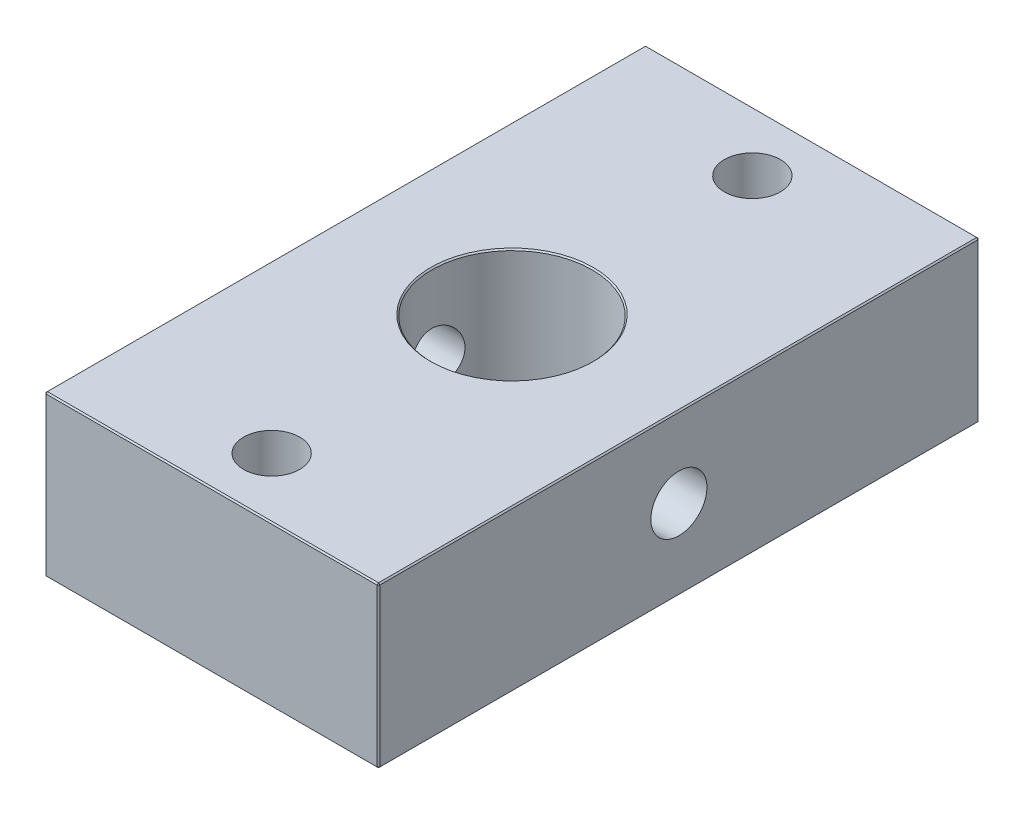
ISO-10303-21;
HEADER;
FILE_DESCRIPTION(('STEP AP214'),'2;1');
FILE_NAME('part.step','',(''),(''),'','','');
FILE_SCHEMA(('AUTOMOTIVE_DESIGN { 1 0 10303 214 1 1 1 1 }'));
ENDSEC;
DATA;
#1=APPLICATION_CONTEXT('core data for automotive mechanical design processes');
#2=APPLICATION_PROTOCOL_DEFINITION('international standard','automotive_design',2000,#1);
#3=PRODUCT_CONTEXT('',#1,'mechanical');
#4=PRODUCT('Part','Part','',(#3));
#5=PRODUCT_RELATED_PRODUCT_CATEGORY('part','',(#4));
#6=PRODUCT_DEFINITION_FORMATION('','',#4);
#7=PRODUCT_DEFINITION_CONTEXT('part definition',#1,'design');
#8=PRODUCT_DEFINITION('design','',#6,#7);
#9=PRODUCT_DEFINITION_SHAPE('','',#8);
#10=(LENGTH_UNIT() NAMED_UNIT(*) SI_UNIT(.MILLI.,.METRE.));
#11=(NAMED_UNIT(*) PLANE_ANGLE_UNIT() SI_UNIT($,.RADIAN.));
#12=(NAMED_UNIT(*) SI_UNIT($,.STERADIAN.) SOLID_ANGLE_UNIT());
#13=UNCERTAINTY_MEASURE_WITH_UNIT(LENGTH_MEASURE(1.E-05),#10,'distance_accuracy_value','');
#14=(GEOMETRIC_REPRESENTATION_CONTEXT(3) GLOBAL_UNCERTAINTY_ASSIGNED_CONTEXT((#13)) GLOBAL_UNIT_ASSIGNED_CONTEXT((#10,
#11,#12)) REPRESENTATION_CONTEXT('',''));
#15=CARTESIAN_POINT('',(0.,0.,0.));
#16=DIRECTION('',(0.,0.,1.));
#17=DIRECTION('',(1.,0.,0.));
#18=AXIS2_PLACEMENT_3D('',#15,#16,#17);
#19=CARTESIAN_POINT('',(0.,12.,0.));
#20=DIRECTION('',(0.,-1.,0.));
#21=DIRECTION('',(0.,0.,-1.));
#22=AXIS2_PLACEMENT_3D('',#19,#20,#21);
#23=PLANE('',#22);
#24=CARTESIAN_POINT('',(0.,12.,0.));
#25=DIRECTION('',(0.,-1.,0.));
#26=DIRECTION('',(0.,0.,-1.));
#27=AXIS2_PLACEMENT_3D('',#24,#25,#26);
#28=CIRCLE('',#27,6.10000000000001);
#29=CARTESIAN_POINT('',(0.,12.,-6.10000000000001));
#30=VERTEX_POINT('',#29);
#31=EDGE_CURVE('E472',#30,#30,#28,.T.);
#32=ORIENTED_EDGE('',*,*,#31,.T.);
#33=EDGE_LOOP('',(#32));
#34=FACE_BOUND('',#33,.T.);
#35=DIRECTION('',(0.,0.,1.));
#36=VECTOR('',#35,1.);
#37=CARTESIAN_POINT('',(-12.4,12.,0.));
#38=LINE('',#37,#36);
#39=CARTESIAN_POINT('',(-12.4,12.,-22.4));
#40=VERTEX_POINT('',#39);
#41=CARTESIAN_POINT('',(-12.4,12.,22.4));
#42=VERTEX_POINT('',#41);
#43=EDGE_CURVE('E463',#40,#42,#38,.T.);
#44=ORIENTED_EDGE('',*,*,#43,.T.);
#45=DIRECTION('',(1.,0.,0.));
#46=VECTOR('',#45,1.);
#47=CARTESIAN_POINT('',(0.,12.,22.4));
#48=LINE('',#47,#46);
#49=CARTESIAN_POINT('',(12.4,12.,22.4));
#50=VERTEX_POINT('',#49);
#51=EDGE_CURVE('E467',#42,#50,#48,.T.);
#52=ORIENTED_EDGE('',*,*,#51,.T.);
#53=DIRECTION('',(0.,0.,-1.));
#54=VECTOR('',#53,1.);
#55=CARTESIAN_POINT('',(12.4,12.,0.));
#56=LINE('',#55,#54);
#57=CARTESIAN_POINT('',(12.4,12.,-22.4));
#58=VERTEX_POINT('',#57);
#59=EDGE_CURVE('E468',#50,#58,#56,.T.);
#60=ORIENTED_EDGE('',*,*,#59,.T.);
#61=DIRECTION('',(-1.,0.,0.));
#62=VECTOR('',#61,1.);
#63=CARTESIAN_POINT('',(0.,12.,-22.4));
#64=LINE('',#63,#62);
#65=EDGE_CURVE('E474',#58,#40,#64,.T.);
#66=ORIENTED_EDGE('',*,*,#65,.T.);
#67=EDGE_LOOP('',(#44,#52,#60,#66));
#68=FACE_BOUND('',#67,.T.);
#69=CARTESIAN_POINT('',(0.,12.,-18.));
#70=DIRECTION('',(0.,1.,0.));
#71=DIRECTION('',(0.,0.,1.));
#72=AXIS2_PLACEMENT_3D('',#69,#70,#71);
#73=CIRCLE('',#72,2.09999999999999);
#74=CARTESIAN_POINT('',(0.,12.,-15.9));
#75=VERTEX_POINT('',#74);
#76=EDGE_CURVE('E245',#75,#75,#73,.T.);
#77=ORIENTED_EDGE('',*,*,#76,.F.);
#78=EDGE_LOOP('',(#77));
#79=FACE_BOUND('',#78,.T.);
#80=CARTESIAN_POINT('',(0.,12.,18.));
#81=DIRECTION('',(0.,1.,0.));
#82=DIRECTION('',(0.,0.,1.));
#83=AXIS2_PLACEMENT_3D('',#80,#81,#82);
#84=CIRCLE('',#83,2.09999999999999);
#85=CARTESIAN_POINT('',(0.,12.,20.1));
#86=VERTEX_POINT('',#85);
#87=EDGE_CURVE('E254',#86,#86,#84,.T.);
#88=ORIENTED_EDGE('',*,*,#87,.F.);
#89=EDGE_LOOP('',(#88));
#90=FACE_BOUND('',#89,.T.);
#91=ADVANCED_FACE('F47',(#34,#68,#79,#90),#23,.F.);
#92=CARTESIAN_POINT('',(0.,0.,0.));
#93=DIRECTION('',(0.,-1.,0.));
#94=DIRECTION('',(0.,0.,-1.));
#95=AXIS2_PLACEMENT_3D('',#92,#93,#94);
#96=PLANE('',#95);
#97=CARTESIAN_POINT('',(0.,0.,0.));
#98=DIRECTION('',(0.,-1.,0.));
#99=DIRECTION('',(0.,0.,-1.));
#100=AXIS2_PLACEMENT_3D('',#97,#98,#99);
#101=CIRCLE('',#100,6.10000000000002);
#102=CARTESIAN_POINT('',(0.,0.,-6.10000000000003));
#103=VERTEX_POINT('',#102);
#104=EDGE_CURVE('E578',#103,#103,#101,.F.);
#105=ORIENTED_EDGE('',*,*,#104,.T.);
#106=EDGE_LOOP('',(#105));
#107=FACE_BOUND('',#106,.T.);
#108=DIRECTION('',(0.,0.,1.));
#109=VECTOR('',#108,1.);
#110=CARTESIAN_POINT('',(12.4,0.,22.5));
#111=LINE('',#110,#109);
#112=CARTESIAN_POINT('',(12.4,0.,-22.4));
#113=VERTEX_POINT('',#112);
#114=CARTESIAN_POINT('',(12.4,0.,22.4));
#115=VERTEX_POINT('',#114);
#116=EDGE_CURVE('E153',#113,#115,#111,.T.);
#117=ORIENTED_EDGE('',*,*,#116,.T.);
#118=DIRECTION('',(-1.,0.,0.));
#119=VECTOR('',#118,1.);
#120=CARTESIAN_POINT('',(-12.5,0.,22.4));
#121=LINE('',#120,#119);
#122=CARTESIAN_POINT('',(-12.4,0.,22.4));
#123=VERTEX_POINT('',#122);
#124=EDGE_CURVE('E148',#115,#123,#121,.T.);
#125=ORIENTED_EDGE('',*,*,#124,.T.);
#126=DIRECTION('',(0.,0.,-1.));
#127=VECTOR('',#126,1.);
#128=CARTESIAN_POINT('',(-12.4,0.,-22.5));
#129=LINE('',#128,#127);
#130=CARTESIAN_POINT('',(-12.4,0.,-22.4));
#131=VERTEX_POINT('',#130);
#132=EDGE_CURVE('E141',#123,#131,#129,.T.);
#133=ORIENTED_EDGE('',*,*,#132,.T.);
#134=DIRECTION('',(1.,0.,0.));
#135=VECTOR('',#134,1.);
#136=CARTESIAN_POINT('',(12.5,0.,-22.4));
#137=LINE('',#136,#135);
#138=EDGE_CURVE('E145',#131,#113,#137,.T.);
#139=ORIENTED_EDGE('',*,*,#138,.T.);
#140=EDGE_LOOP('',(#117,#125,#133,#139));
#141=FACE_BOUND('',#140,.T.);
#142=CARTESIAN_POINT('',(0.,0.,-18.));
#143=DIRECTION('',(0.,1.,0.));
#144=DIRECTION('',(0.,0.,1.));
#145=AXIS2_PLACEMENT_3D('',#142,#143,#144);
#146=CIRCLE('',#145,2.1);
#147=CARTESIAN_POINT('',(0.,0.,-15.9));
#148=VERTEX_POINT('',#147);
#149=EDGE_CURVE('E249',#148,#148,#146,.T.);
#150=ORIENTED_EDGE('',*,*,#149,.T.);
#151=EDGE_LOOP('',(#150));
#152=FACE_BOUND('',#151,.T.);
#153=CARTESIAN_POINT('',(0.,0.,18.));
#154=DIRECTION('',(0.,1.,0.));
#155=DIRECTION('',(0.,0.,1.));
#156=AXIS2_PLACEMENT_3D('',#153,#154,#155);
#157=CIRCLE('',#156,2.1);
#158=CARTESIAN_POINT('',(0.,0.,20.1));
#159=VERTEX_POINT('',#158);
#160=EDGE_CURVE('E166',#159,#159,#157,.T.);
#161=ORIENTED_EDGE('',*,*,#160,.T.);
#162=EDGE_LOOP('',(#161));
#163=FACE_BOUND('',#162,.T.);
#164=ADVANCED_FACE('F143',(#107,#141,#152,#163),#96,.T.);
#165=CARTESIAN_POINT('',(12.5,12.,22.5));
#166=DIRECTION('',(-1.,0.,0.));
#167=DIRECTION('',(0.,0.,1.));
#168=AXIS2_PLACEMENT_3D('',#165,#166,#167);
#169=PLANE('',#168);
#170=DIRECTION('',(0.,0.,1.));
#171=VECTOR('',#170,1.);
#172=CARTESIAN_POINT('',(12.5,11.9,22.5));
#173=LINE('',#172,#171);
#174=CARTESIAN_POINT('',(12.5,11.9,-22.4));
#175=VERTEX_POINT('',#174);
#176=CARTESIAN_POINT('',(12.5,11.9,22.4));
#177=VERTEX_POINT('',#176);
#178=EDGE_CURVE('E496',#175,#177,#173,.T.);
#179=ORIENTED_EDGE('',*,*,#178,.T.);
#180=DIRECTION('',(0.,-1.,0.));
#181=VECTOR('',#180,1.);
#182=CARTESIAN_POINT('',(12.5,12.,22.4));
#183=LINE('',#182,#181);
#184=CARTESIAN_POINT('',(12.5,0.099999999999989,22.4));
#185=VERTEX_POINT('',#184);
#186=EDGE_CURVE('E502',#177,#185,#183,.T.);
#187=ORIENTED_EDGE('',*,*,#186,.T.);
#188=DIRECTION('',(0.,0.,-1.));
#189=VECTOR('',#188,1.);
#190=CARTESIAN_POINT('',(12.5,0.099999999999989,-22.5));
#191=LINE('',#190,#189);
#192=CARTESIAN_POINT('',(12.5,0.099999999999989,-22.4));
#193=VERTEX_POINT('',#192);
#194=EDGE_CURVE('E499',#185,#193,#191,.T.);
#195=ORIENTED_EDGE('',*,*,#194,.T.);
#196=DIRECTION('',(0.,1.,0.));
#197=VECTOR('',#196,1.);
#198=CARTESIAN_POINT('',(12.5,12.,-22.4));
#199=LINE('',#198,#197);
#200=EDGE_CURVE('E493',#193,#175,#199,.T.);
#201=ORIENTED_EDGE('',*,*,#200,.T.);
#202=EDGE_LOOP('',(#179,#187,#195,#201));
#203=FACE_BOUND('',#202,.T.);
#204=CARTESIAN_POINT('',(12.5,6.,0.));
#205=DIRECTION('',(-1.,0.,0.));
#206=DIRECTION('',(0.,0.,1.));
#207=AXIS2_PLACEMENT_3D('',#204,#205,#206);
#208=CIRCLE('',#207,2.1);
#209=CARTESIAN_POINT('',(12.5,6.,2.1));
#210=VERTEX_POINT('',#209);
#211=EDGE_CURVE('E236',#210,#210,#208,.T.);
#212=ORIENTED_EDGE('',*,*,#211,.T.);
#213=EDGE_LOOP('',(#212));
#214=FACE_BOUND('',#213,.T.);
#215=ADVANCED_FACE('F301',(#203,#214),#169,.F.);
#216=CARTESIAN_POINT('',(-12.5,12.,-22.5));
#217=DIRECTION('',(0.,0.,1.));
#218=DIRECTION('',(1.,0.,0.));
#219=AXIS2_PLACEMENT_3D('',#216,#217,#218);
#220=PLANE('',#219);
#221=DIRECTION('',(-1.,0.,0.));
#222=VECTOR('',#221,1.);
#223=CARTESIAN_POINT('',(-12.5,0.099999999999989,-22.5));
#224=LINE('',#223,#222);
#225=CARTESIAN_POINT('',(12.4,0.099999999999989,-22.5));
#226=VERTEX_POINT('',#225);
#227=CARTESIAN_POINT('',(-12.4,0.099999999999989,-22.5));
#228=VERTEX_POINT('',#227);
#229=EDGE_CURVE('E518',#226,#228,#224,.T.);
#230=ORIENTED_EDGE('',*,*,#229,.T.);
#231=DIRECTION('',(0.,1.,0.));
#232=VECTOR('',#231,1.);
#233=CARTESIAN_POINT('',(-12.4,12.,-22.5));
#234=LINE('',#233,#232);
#235=CARTESIAN_POINT('',(-12.4,11.9,-22.5));
#236=VERTEX_POINT('',#235);
#237=EDGE_CURVE('E11',#228,#236,#234,.T.);
#238=ORIENTED_EDGE('',*,*,#237,.T.);
#239=DIRECTION('',(1.,0.,0.));
#240=VECTOR('',#239,1.);
#241=CARTESIAN_POINT('',(-12.5,11.9,-22.5));
#242=LINE('',#241,#240);
#243=CARTESIAN_POINT('',(12.4,11.9,-22.5));
#244=VERTEX_POINT('',#243);
#245=EDGE_CURVE('E58',#236,#244,#242,.T.);
#246=ORIENTED_EDGE('',*,*,#245,.T.);
#247=DIRECTION('',(0.,-1.,0.));
#248=VECTOR('',#247,1.);
#249=CARTESIAN_POINT('',(12.4,12.,-22.5));
#250=LINE('',#249,#248);
#251=EDGE_CURVE('E521',#244,#226,#250,.T.);
#252=ORIENTED_EDGE('',*,*,#251,.T.);
#253=EDGE_LOOP('',(#230,#238,#246,#252));
#254=FACE_BOUND('',#253,.T.);
#255=ADVANCED_FACE('F313',(#254),#220,.F.);
#256=CARTESIAN_POINT('',(-12.5,12.,22.5));
#257=DIRECTION('',(1.,0.,0.));
#258=DIRECTION('',(0.,0.,-1.));
#259=AXIS2_PLACEMENT_3D('',#256,#257,#258);
#260=PLANE('',#259);
#261=DIRECTION('',(0.,0.,1.));
#262=VECTOR('',#261,1.);
#263=CARTESIAN_POINT('',(-12.5,0.099999999999989,22.5));
#264=LINE('',#263,#262);
#265=CARTESIAN_POINT('',(-12.5,0.099999999999989,-22.4));
#266=VERTEX_POINT('',#265);
#267=CARTESIAN_POINT('',(-12.5,0.099999999999989,22.4));
#268=VERTEX_POINT('',#267);
#269=EDGE_CURVE('E179',#266,#268,#264,.T.);
#270=ORIENTED_EDGE('',*,*,#269,.T.);
#271=DIRECTION('',(0.,1.,0.));
#272=VECTOR('',#271,1.);
#273=CARTESIAN_POINT('',(-12.5,12.,22.4));
#274=LINE('',#273,#272);
#275=CARTESIAN_POINT('',(-12.5,11.9,22.4));
#276=VERTEX_POINT('',#275);
#277=EDGE_CURVE('E514',#268,#276,#274,.T.);
#278=ORIENTED_EDGE('',*,*,#277,.T.);
#279=DIRECTION('',(0.,0.,-1.));
#280=VECTOR('',#279,1.);
#281=CARTESIAN_POINT('',(-12.5,11.9,22.5));
#282=LINE('',#281,#280);
#283=CARTESIAN_POINT('',(-12.5,11.9,-22.4));
#284=VERTEX_POINT('',#283);
#285=EDGE_CURVE('E509',#276,#284,#282,.T.);
#286=ORIENTED_EDGE('',*,*,#285,.T.);
#287=DIRECTION('',(0.,-1.,0.));
#288=VECTOR('',#287,1.);
#289=CARTESIAN_POINT('',(-12.5,12.,-22.4));
#290=LINE('',#289,#288);
#291=EDGE_CURVE('E506',#284,#266,#290,.T.);
#292=ORIENTED_EDGE('',*,*,#291,.T.);
#293=EDGE_LOOP('',(#270,#278,#286,#292));
#294=FACE_BOUND('',#293,.T.);
#295=CARTESIAN_POINT('',(-12.5,6.,0.));
#296=DIRECTION('',(-1.,0.,0.));
#297=DIRECTION('',(0.,0.,1.));
#298=AXIS2_PLACEMENT_3D('',#295,#296,#297);
#299=CIRCLE('',#298,2.09999999999999);
#300=CARTESIAN_POINT('',(-12.5,6.,2.09999999999999));
#301=VERTEX_POINT('',#300);
#302=EDGE_CURVE('E230',#301,#301,#299,.T.);
#303=ORIENTED_EDGE('',*,*,#302,.F.);
#304=EDGE_LOOP('',(#303));
#305=FACE_BOUND('',#304,.T.);
#306=ADVANCED_FACE('F309',(#294,#305),#260,.F.);
#307=CARTESIAN_POINT('',(-12.5,12.,22.5));
#308=DIRECTION('',(0.,0.,-1.));
#309=DIRECTION('',(-1.,0.,0.));
#310=AXIS2_PLACEMENT_3D('',#307,#308,#309);
#311=PLANE('',#310);
#312=DIRECTION('',(0.,-1.,0.));
#313=VECTOR('',#312,1.);
#314=CARTESIAN_POINT('',(-12.4,12.,22.5));
#315=LINE('',#314,#313);
#316=CARTESIAN_POINT('',(-12.4,11.9,22.5));
#317=VERTEX_POINT('',#316);
#318=CARTESIAN_POINT('',(-12.4,0.099999999999989,22.5));
#319=VERTEX_POINT('',#318);
#320=EDGE_CURVE('E483',#317,#319,#315,.T.);
#321=ORIENTED_EDGE('',*,*,#320,.T.);
#322=DIRECTION('',(1.,0.,0.));
#323=VECTOR('',#322,1.);
#324=CARTESIAN_POINT('',(12.5,0.099999999999989,22.5));
#325=LINE('',#324,#323);
#326=CARTESIAN_POINT('',(12.4,0.099999999999989,22.5));
#327=VERTEX_POINT('',#326);
#328=EDGE_CURVE('E489',#319,#327,#325,.T.);
#329=ORIENTED_EDGE('',*,*,#328,.T.);
#330=DIRECTION('',(0.,1.,0.));
#331=VECTOR('',#330,1.);
#332=CARTESIAN_POINT('',(12.4,12.,22.5));
#333=LINE('',#332,#331);
#334=CARTESIAN_POINT('',(12.4,11.9,22.5));
#335=VERTEX_POINT('',#334);
#336=EDGE_CURVE('E486',#327,#335,#333,.T.);
#337=ORIENTED_EDGE('',*,*,#336,.T.);
#338=DIRECTION('',(-1.,0.,0.));
#339=VECTOR('',#338,1.);
#340=CARTESIAN_POINT('',(-12.5,11.9,22.5));
#341=LINE('',#340,#339);
#342=EDGE_CURVE('E480',#335,#317,#341,.T.);
#343=ORIENTED_EDGE('',*,*,#342,.T.);
#344=EDGE_LOOP('',(#321,#329,#337,#343));
#345=FACE_BOUND('',#344,.T.);
#346=ADVANCED_FACE('F292',(#345),#311,.F.);
#347=CARTESIAN_POINT('',(0.,12.,0.));
#348=DIRECTION('',(0.,-1.,0.));
#349=DIRECTION('',(0.,0.,-1.));
#350=AXIS2_PLACEMENT_3D('',#347,#348,#349);
#351=CYLINDRICAL_SURFACE('',#350,6.);
#352=CARTESIAN_POINT('',(0.,0.10000000000002,0.));
#353=DIRECTION('',(0.,-1.,0.));
#354=DIRECTION('',(0.,0.,-1.));
#355=AXIS2_PLACEMENT_3D('',#352,#353,#354);
#356=CIRCLE('',#355,6.);
#357=CARTESIAN_POINT('',(0.,0.10000000000002,-6.));
#358=VERTEX_POINT('',#357);
#359=EDGE_CURVE('E569',#358,#358,#356,.T.);
#360=ORIENTED_EDGE('',*,*,#359,.T.);
#361=EDGE_LOOP('',(#360));
#362=FACE_BOUND('',#361,.T.);
#363=CARTESIAN_POINT('',(0.,11.9,0.));
#364=DIRECTION('',(0.,-1.,0.));
#365=DIRECTION('',(0.,0.,-1.));
#366=AXIS2_PLACEMENT_3D('',#363,#364,#365);
#367=CIRCLE('',#366,6.);
#368=CARTESIAN_POINT('',(0.,11.9,-6.));
#369=VERTEX_POINT('',#368);
#370=EDGE_CURVE('E572',#369,#369,#367,.F.);
#371=ORIENTED_EDGE('',*,*,#370,.T.);
#372=EDGE_LOOP('',(#371));
#373=FACE_BOUND('',#372,.T.);
#374=CARTESIAN_POINT('',(5.62049819855856,6.,2.09999999999999));
#375=CARTESIAN_POINT('',(5.62049664583151,6.1140091370659,2.10000183392046));
#376=CARTESIAN_POINT('',(5.62400496831304,6.22800549976909,2.09068443415069));
#377=CARTESIAN_POINT('',(5.63757664755876,6.45259753612682,2.05380341211709));
#378=CARTESIAN_POINT('',(5.64764054896648,6.5631929264259,2.02623827381127));
#379=CARTESIAN_POINT('',(5.67304678569866,6.77768801016566,1.95396754262051));
#380=CARTESIAN_POINT('',(5.6883778981936,6.88160138658303,1.90929837025929));
#381=CARTESIAN_POINT('',(5.72257413857459,7.08049606044283,1.80421393109002));
#382=CARTESIAN_POINT('',(5.74144016463705,7.17547507854585,1.74379466085327));
#383=CARTESIAN_POINT('',(5.78149405495312,7.35790717006958,1.60612976379037));
#384=CARTESIAN_POINT('',(5.80274397711166,7.44491870630237,1.52831692511238));
#385=CARTESIAN_POINT('',(5.84464952300565,7.60496249641997,1.35928149750692));
#386=CARTESIAN_POINT('',(5.86530503931134,7.67799223662497,1.26805650251292));
#387=CARTESIAN_POINT('',(5.90442033428759,7.81005007735196,1.07151011163135));
#388=CARTESIAN_POINT('',(5.92279871940295,7.86860885404572,0.965855744444183));
#389=CARTESIAN_POINT('',(5.95455216146555,7.96694377064913,0.745440860528096));
#390=CARTESIAN_POINT('',(5.96792871449917,8.00672552784473,0.630683079168857));
#391=CARTESIAN_POINT('',(5.98773140637401,8.06486014648584,0.399953329353733));
#392=CARTESIAN_POINT('',(5.99440266306354,8.08397084703124,0.284193742860485));
#393=CARTESIAN_POINT('',(6.00091688970397,8.10263770519153,0.0509313612862907));
#394=CARTESIAN_POINT('',(6.00076179631715,8.10219940893304,-0.0665709299256015));
#395=CARTESIAN_POINT('',(5.99380298814009,8.08224623019269,-0.294593124821954));
#396=CARTESIAN_POINT('',(5.98728668132325,8.06355598179706,-0.405195428634551));
#397=CARTESIAN_POINT('',(5.9687047041447,8.00900218324641,-0.621581077155496));
#398=CARTESIAN_POINT('',(5.95663864919881,7.97313744293342,-0.727364087339984));
#399=CARTESIAN_POINT('',(5.92796321816309,7.88481041807335,-0.932828899090624));
#400=CARTESIAN_POINT('',(5.91129353147343,7.83212624879887,-1.032406550088));
#401=CARTESIAN_POINT('',(5.87512754462534,7.71184352800499,-1.22154070440799));
#402=CARTESIAN_POINT('',(5.85563040547433,7.64424054649508,-1.31109421923475));
#403=CARTESIAN_POINT('',(5.81466073961639,7.49195271186357,-1.48252795143936));
#404=CARTESIAN_POINT('',(5.79313819397398,7.40656677898385,-1.56377436704444));
#405=CARTESIAN_POINT('',(5.75137417926811,7.22321760973066,-1.71101327031471));
#406=CARTESIAN_POINT('',(5.7311329525691,7.12525200443312,-1.77700287834317));
#407=CARTESIAN_POINT('',(5.69393293954877,6.91732795856173,-1.89285691923176));
#408=CARTESIAN_POINT('',(5.67703632147327,6.80719282631497,-1.94242576165357));
#409=CARTESIAN_POINT('',(5.64915572593063,6.57939519101917,-2.02208854460282));
#410=CARTESIAN_POINT('',(5.63816896261968,6.4617362639265,-2.05219166242462));
#411=CARTESIAN_POINT('',(5.62399263581829,6.2284219502318,-2.09071998372687));
#412=CARTESIAN_POINT('',(5.62044649299884,6.11295216142979,-2.10013762361126));
#413=CARTESIAN_POINT('',(5.62055101387309,5.88205250370018,-2.09985940605159));
#414=CARTESIAN_POINT('',(5.62420019227554,5.76662263145225,-2.09016749328915));
#415=CARTESIAN_POINT('',(5.63792601318417,5.54380912898156,-2.05284050372257));
#416=CARTESIAN_POINT('',(5.64774496069313,5.43628747984392,-2.02592405668402));
#417=CARTESIAN_POINT('',(5.67241183587194,5.22731815862595,-1.95579041232058));
#418=CARTESIAN_POINT('',(5.68726071086302,5.12587163495472,-1.91257014420931));
#419=CARTESIAN_POINT('',(5.72093971005748,4.92809433349761,-1.80938709290031));
#420=CARTESIAN_POINT('',(5.73988830803676,4.83205588297778,-1.74890374170464));
#421=CARTESIAN_POINT('',(5.77941412178294,4.65113493086169,-1.61348700379827));
#422=CARTESIAN_POINT('',(5.79999186281896,4.56625605100199,-1.53854894531553));
#423=CARTESIAN_POINT('',(5.84179871415577,4.40532762874549,-1.37155948469131));
#424=CARTESIAN_POINT('',(5.86300314137944,4.33000068441339,-1.27880333095807));
#425=CARTESIAN_POINT('',(5.90259223696936,4.19591891840493,-1.08144356167349));
#426=CARTESIAN_POINT('',(5.92097697084181,4.13716371171272,-0.97684022145032));
#427=CARTESIAN_POINT('',(5.95279281741868,4.03838744346696,-0.759129698059021));
#428=CARTESIAN_POINT('',(5.96625139312545,3.99826217380438,-0.646074027219709));
#429=CARTESIAN_POINT('',(5.9868116209636,3.93778465141936,-0.414248850041624));
#430=CARTESIAN_POINT('',(5.99391583149341,3.91742444059474,-0.295481663590938));
#431=CARTESIAN_POINT('',(6.00075437840247,3.89782775243787,-0.0621821302514103));
#432=CARTESIAN_POINT('',(6.00084903050369,3.89755852291671,0.0522537808564091));
#433=CARTESIAN_POINT('',(5.99456520252124,3.91556165774852,0.279465044357222));
#434=CARTESIAN_POINT('',(5.98818734124803,3.93383224958516,0.392240554448669));
#435=CARTESIAN_POINT('',(5.96982073900785,3.98769281511968,0.6107781836459));
#436=CARTESIAN_POINT('',(5.95794088668529,4.0229471878998,0.716632835676153));
#437=CARTESIAN_POINT('',(5.92979682904224,4.10945562590669,0.920954416283842));
#438=CARTESIAN_POINT('',(5.9135318086933,4.16071266567333,1.01941996716771));
#439=CARTESIAN_POINT('',(5.87748193017465,4.2800726297771,1.21038035179718));
#440=CARTESIAN_POINT('',(5.85758416144814,4.34875672859405,1.30249027603846));
#441=CARTESIAN_POINT('',(5.81674433892569,4.50006159937586,1.47420813664784));
#442=CARTESIAN_POINT('',(5.79580193683871,4.58268704169578,1.55381186612155));
#443=CARTESIAN_POINT('',(5.75411472954402,4.7639022541288,1.70186578231573));
#444=CARTESIAN_POINT('',(5.73341989776723,4.86303759965216,1.76966457617208));
#445=CARTESIAN_POINT('',(5.69567813634371,5.07194862858987,1.88761831198949));
#446=CARTESIAN_POINT('',(5.67863073469664,5.18172293258172,1.9377755374217));
#447=CARTESIAN_POINT('',(5.65052522432762,5.40768257816286,2.0182610046831));
#448=CARTESIAN_POINT('',(5.63940282619449,5.52378337592957,2.04880286372059));
#449=CARTESIAN_POINT('',(5.62439175486356,5.7599286991957,2.08966685598282));
#450=CARTESIAN_POINT('',(5.62049983326622,5.87997142904268,2.09999806925252));
#451=CARTESIAN_POINT('',(5.62049819855856,6.,2.09999999999999));
#452=B_SPLINE_CURVE_WITH_KNOTS('',3,(#374,#375,#376,#377,#378,#379,#380,#381,#382,#383,#384,
#385,#386,#387,#388,#389,#390,#391,#392,#393,#394,#395,#396,#397,#398,#399,#400,#401,#402,#403,
#404,#405,#406,#407,#408,#409,#410,#411,#412,#413,#414,#415,#416,#417,#418,#419,#420,#421,#422,
#423,#424,#425,#426,#427,#428,#429,#430,#431,#432,#433,#434,#435,#436,#437,#438,#439,#440,#441,
#442,#443,#444,#445,#446,#447,#448,#449,#450,#451),.UNSPECIFIED.,.T.,.F.,(4,2,2,2,2,2,2,2,2,2,2,
2,2,2,2,2,2,2,2,2,2,2,2,2,2,2,2,2,2,2,2,2,2,2,2,2,2,2,4),(0.,0.341581962713036,
0.683192307989642,1.02407925348462,1.36505293174606,1.71940579240762,2.07382229975039,
2.43855298376331,2.80317448659719,3.15392083853409,3.50456768299669,3.84007194782349,
4.17559946579063,4.51575014165978,4.85600195806707,5.21379905942499,5.57166363794493,
5.93565848344082,6.29948159486755,6.6454288702843,6.99130474115208,7.32361553252674,
7.65598894513419,7.99969400689681,8.34351034108724,8.70586039893278,9.06820203750371,
9.42849171734221,9.78863627174603,10.1302545747611,10.471840220127,10.806936933281,
11.1420959705822,11.4903822545165,11.8387854469785,12.2026433598833,12.5664541587759,
12.9262325794049,13.2858493250833),.UNSPECIFIED.);
#453=CARTESIAN_POINT('',(5.62049819855856,6.,2.09999999999999));
#454=VERTEX_POINT('',#453);
#455=EDGE_CURVE('E250',#454,#454,#452,.T.);
#456=ORIENTED_EDGE('',*,*,#455,.F.);
#457=EDGE_LOOP('',(#456));
#458=FACE_BOUND('',#457,.T.);
#459=CARTESIAN_POINT('',(-5.62049819855856,6.,2.09999999999999));
#460=CARTESIAN_POINT('',(-5.62049664583151,5.8859908629341,2.10000183392046));
#461=CARTESIAN_POINT('',(-5.62400496831304,5.77199450023092,2.09068443415069));
#462=CARTESIAN_POINT('',(-5.63757664755876,5.54740246387318,2.05380341211709));
#463=CARTESIAN_POINT('',(-5.64764054896648,5.4368070735741,2.02623827381127));
#464=CARTESIAN_POINT('',(-5.67304678569866,5.22231198983434,1.95396754262051));
#465=CARTESIAN_POINT('',(-5.6883778981936,5.11839861341697,1.90929837025928));
#466=CARTESIAN_POINT('',(-5.72257413857459,4.91950393955718,1.80421393109002));
#467=CARTESIAN_POINT('',(-5.74144016463705,4.82452492145415,1.74379466085327));
#468=CARTESIAN_POINT('',(-5.78149405495312,4.64209282993042,1.60612976379037));
#469=CARTESIAN_POINT('',(-5.80274397711165,4.55508129369763,1.52831692511238));
#470=CARTESIAN_POINT('',(-5.84464952300565,4.39503750358004,1.35928149750692));
#471=CARTESIAN_POINT('',(-5.86530503931134,4.32200776337504,1.26805650251292));
#472=CARTESIAN_POINT('',(-5.90442033428759,4.18994992264805,1.07151011163135));
#473=CARTESIAN_POINT('',(-5.92279871940295,4.13139114595428,0.965855744444182));
#474=CARTESIAN_POINT('',(-5.95455216146555,4.03305622935087,0.745440860528095));
#475=CARTESIAN_POINT('',(-5.96792871449917,3.99327447215528,0.630683079168856));
#476=CARTESIAN_POINT('',(-5.987731406374,3.93513985351416,0.399953329353732));
#477=CARTESIAN_POINT('',(-5.99440266306354,3.91602915296876,0.284193742860484));
#478=CARTESIAN_POINT('',(-6.00091688970396,3.89736229480847,0.0509313612862904));
#479=CARTESIAN_POINT('',(-6.00076179631714,3.89780059106697,-0.0665709299256019));
#480=CARTESIAN_POINT('',(-5.99380298814009,3.91775376980732,-0.294593124821954));
#481=CARTESIAN_POINT('',(-5.98728668132325,3.93644401820294,-0.405195428634551));
#482=CARTESIAN_POINT('',(-5.96870470414469,3.99099781675359,-0.621581077155496));
#483=CARTESIAN_POINT('',(-5.95663864919881,4.02686255706659,-0.727364087339983));
#484=CARTESIAN_POINT('',(-5.92796321816309,4.11518958192665,-0.932828899090623));
#485=CARTESIAN_POINT('',(-5.91129353147342,4.16787375120114,-1.032406550088));
#486=CARTESIAN_POINT('',(-5.87512754462534,4.28815647199501,-1.22154070440798));
#487=CARTESIAN_POINT('',(-5.85563040547432,4.35575945350492,-1.31109421923474));
#488=CARTESIAN_POINT('',(-5.81466073961639,4.50804728813644,-1.48252795143936));
#489=CARTESIAN_POINT('',(-5.79313819397397,4.59343322101615,-1.56377436704444));
#490=CARTESIAN_POINT('',(-5.7513741792681,4.77678239026934,-1.71101327031471));
#491=CARTESIAN_POINT('',(-5.7311329525691,4.87474799556688,-1.77700287834317));
#492=CARTESIAN_POINT('',(-5.69393293954876,5.08267204143828,-1.89285691923176));
#493=CARTESIAN_POINT('',(-5.67703632147327,5.19280717368503,-1.94242576165357));
#494=CARTESIAN_POINT('',(-5.64915572593063,5.42060480898083,-2.02208854460282));
#495=CARTESIAN_POINT('',(-5.63816896261968,5.5382637360735,-2.05219166242462));
#496=CARTESIAN_POINT('',(-5.62399263581829,5.7715780497682,-2.09071998372687));
#497=CARTESIAN_POINT('',(-5.62044649299884,5.88704783857021,-2.10013762361126));
#498=CARTESIAN_POINT('',(-5.62055101387309,6.11794749629983,-2.09985940605159));
#499=CARTESIAN_POINT('',(-5.62420019227554,6.23337736854775,-2.09016749328915));
#500=CARTESIAN_POINT('',(-5.63792601318417,6.45619087101844,-2.05284050372257));
#501=CARTESIAN_POINT('',(-5.64774496069313,6.56371252015608,-2.02592405668402));
#502=CARTESIAN_POINT('',(-5.67241183587194,6.77268184137405,-1.95579041232058));
#503=CARTESIAN_POINT('',(-5.68726071086302,6.87412836504528,-1.91257014420931));
#504=CARTESIAN_POINT('',(-5.72093971005748,7.07190566650239,-1.80938709290031));
#505=CARTESIAN_POINT('',(-5.73988830803675,7.16794411702222,-1.74890374170464));
#506=CARTESIAN_POINT('',(-5.77941412178294,7.34886506913831,-1.61348700379827));
#507=CARTESIAN_POINT('',(-5.79999186281896,7.43374394899801,-1.53854894531553));
#508=CARTESIAN_POINT('',(-5.84179871415577,7.59467237125451,-1.37155948469131));
#509=CARTESIAN_POINT('',(-5.86300314137944,7.66999931558662,-1.27880333095807));
#510=CARTESIAN_POINT('',(-5.90259223696936,7.80408108159507,-1.08144356167349));
#511=CARTESIAN_POINT('',(-5.92097697084181,7.86283628828728,-0.97684022145032));
#512=CARTESIAN_POINT('',(-5.95279281741867,7.96161255653305,-0.759129698059022));
#513=CARTESIAN_POINT('',(-5.96625139312544,8.00173782619562,-0.646074027219711));
#514=CARTESIAN_POINT('',(-5.9868116209636,8.06221534858065,-0.414248850041626));
#515=CARTESIAN_POINT('',(-5.99391583149341,8.08257555940526,-0.29548166359094));
#516=CARTESIAN_POINT('',(-6.00075437840247,8.10217224756213,-0.0621821302514117));
#517=CARTESIAN_POINT('',(-6.00084903050369,8.1024414770833,0.0522537808564072));
#518=CARTESIAN_POINT('',(-5.99456520252123,8.08443834225148,0.27946504435722));
#519=CARTESIAN_POINT('',(-5.98818734124803,8.06616775041485,0.392240554448668));
#520=CARTESIAN_POINT('',(-5.96982073900785,8.01230718488032,0.610778183645899));
#521=CARTESIAN_POINT('',(-5.95794088668528,7.9770528121002,0.716632835676151));
#522=CARTESIAN_POINT('',(-5.92979682904223,7.89054437409331,0.92095441628384));
#523=CARTESIAN_POINT('',(-5.9135318086933,7.83928733432667,1.01941996716771));
#524=CARTESIAN_POINT('',(-5.87748193017464,7.7199273702229,1.21038035179718));
#525=CARTESIAN_POINT('',(-5.85758416144813,7.65124327140596,1.30249027603846));
#526=CARTESIAN_POINT('',(-5.81674433892569,7.49993840062415,1.47420813664784));
#527=CARTESIAN_POINT('',(-5.7958019368387,7.41731295830422,1.55381186612155));
#528=CARTESIAN_POINT('',(-5.75411472954402,7.23609774587121,1.70186578231573));
#529=CARTESIAN_POINT('',(-5.73341989776723,7.13696240034784,1.76966457617208));
#530=CARTESIAN_POINT('',(-5.6956781363437,6.92805137141014,1.88761831198949));
#531=CARTESIAN_POINT('',(-5.67863073469664,6.81827706741828,1.9377755374217));
#532=CARTESIAN_POINT('',(-5.65052522432762,6.59231742183714,2.0182610046831));
#533=CARTESIAN_POINT('',(-5.63940282619449,6.47621662407043,2.04880286372059));
#534=CARTESIAN_POINT('',(-5.62439175486355,6.24007130080431,2.08966685598282));
#535=CARTESIAN_POINT('',(-5.62049983326621,6.12002857095732,2.09999806925252));
#536=CARTESIAN_POINT('',(-5.62049819855856,6.,2.09999999999999));
#537=B_SPLINE_CURVE_WITH_KNOTS('',3,(#459,#460,#461,#462,#463,#464,#465,#466,#467,#468,#469,
#470,#471,#472,#473,#474,#475,#476,#477,#478,#479,#480,#481,#482,#483,#484,#485,#486,#487,#488,
#489,#490,#491,#492,#493,#494,#495,#496,#497,#498,#499,#500,#501,#502,#503,#504,#505,#506,#507,
#508,#509,#510,#511,#512,#513,#514,#515,#516,#517,#518,#519,#520,#521,#522,#523,#524,#525,#526,
#527,#528,#529,#530,#531,#532,#533,#534,#535,#536),.UNSPECIFIED.,.T.,.F.,(4,2,2,2,2,2,2,2,2,2,2,
2,2,2,2,2,2,2,2,2,2,2,2,2,2,2,2,2,2,2,2,2,2,2,2,2,2,2,4),(0.,0.341581962713036,
0.683192307989642,1.02407925348462,1.36505293174606,1.71940579240762,2.07382229975039,
2.43855298376331,2.80317448659719,3.15392083853409,3.5045676829967,3.84007194782349,
4.17559946579063,4.51575014165978,4.85600195806707,5.21379905942499,5.57166363794493,
5.93565848344082,6.29948159486755,6.6454288702843,6.99130474115208,7.32361553252674,
7.65598894513419,7.99969400689681,8.34351034108724,8.70586039893278,9.06820203750371,
9.4284917173422,9.78863627174602,10.1302545747611,10.471840220127,10.806936933281,
11.1420959705822,11.4903822545165,11.8387854469785,12.2026433598833,12.5664541587759,
12.9262325794049,13.2858493250833),.UNSPECIFIED.);
#538=CARTESIAN_POINT('',(-5.62049819855856,6.,2.09999999999999));
#539=VERTEX_POINT('',#538);
#540=EDGE_CURVE('E242',#539,#539,#537,.T.);
#541=ORIENTED_EDGE('',*,*,#540,.F.);
#542=EDGE_LOOP('',(#541));
#543=FACE_BOUND('',#542,.T.);
#544=ADVANCED_FACE('F272',(#362,#373,#458,#543),#351,.F.);
#545=CARTESIAN_POINT('',(0.,12.,18.));
#546=DIRECTION('',(0.,1.,0.));
#547=DIRECTION('',(0.,0.,1.));
#548=AXIS2_PLACEMENT_3D('',#545,#546,#547);
#549=CYLINDRICAL_SURFACE('',#548,2.09999999999999);
#550=ORIENTED_EDGE('',*,*,#160,.F.);
#551=EDGE_LOOP('',(#550));
#552=FACE_BOUND('',#551,.T.);
#553=ORIENTED_EDGE('',*,*,#87,.T.);
#554=EDGE_LOOP('',(#553));
#555=FACE_BOUND('',#554,.T.);
#556=ADVANCED_FACE('F285',(#552,#555),#549,.F.);
#557=CARTESIAN_POINT('',(0.,12.,-18.));
#558=DIRECTION('',(0.,1.,0.));
#559=DIRECTION('',(0.,0.,1.));
#560=AXIS2_PLACEMENT_3D('',#557,#558,#559);
#561=CYLINDRICAL_SURFACE('',#560,2.09999999999999);
#562=ORIENTED_EDGE('',*,*,#149,.F.);
#563=EDGE_LOOP('',(#562));
#564=FACE_BOUND('',#563,.T.);
#565=ORIENTED_EDGE('',*,*,#76,.T.);
#566=EDGE_LOOP('',(#565));
#567=FACE_BOUND('',#566,.T.);
#568=ADVANCED_FACE('F281',(#564,#567),#561,.F.);
#569=CARTESIAN_POINT('',(-12.5,6.,0.));
#570=DIRECTION('',(-1.,0.,0.));
#571=DIRECTION('',(0.,0.,1.));
#572=AXIS2_PLACEMENT_3D('',#569,#570,#571);
#573=CYLINDRICAL_SURFACE('',#572,2.09999999999999);
#574=ORIENTED_EDGE('',*,*,#540,.T.);
#575=EDGE_LOOP('',(#574));
#576=FACE_BOUND('',#575,.T.);
#577=ORIENTED_EDGE('',*,*,#302,.T.);
#578=EDGE_LOOP('',(#577));
#579=FACE_BOUND('',#578,.T.);
#580=ADVANCED_FACE('F276',(#576,#579),#573,.F.);
#581=ORIENTED_EDGE('',*,*,#455,.T.);
#582=EDGE_LOOP('',(#581));
#583=FACE_BOUND('',#582,.T.);
#584=ORIENTED_EDGE('',*,*,#211,.F.);
#585=EDGE_LOOP('',(#584));
#586=FACE_BOUND('',#585,.T.);
#587=ADVANCED_FACE('F280',(#583,#586),#573,.F.);
#588=CARTESIAN_POINT('',(0.,0.,0.));
#589=DIRECTION('',(0.,-1.,0.));
#590=DIRECTION('',(0.,0.,-1.));
#591=AXIS2_PLACEMENT_3D('',#588,#589,#590);
#592=CONICAL_SURFACE('',#591,6.10000000000002,0.785398163397453);
#593=ORIENTED_EDGE('',*,*,#359,.F.);
#594=EDGE_LOOP('',(#593));
#595=FACE_BOUND('',#594,.T.);
#596=ORIENTED_EDGE('',*,*,#104,.F.);
#597=EDGE_LOOP('',(#596));
#598=FACE_BOUND('',#597,.T.);
#599=ADVANCED_FACE('F321',(#595,#598),#592,.F.);
#600=CARTESIAN_POINT('',(0.,11.9,0.));
#601=DIRECTION('',(0.,1.,0.));
#602=DIRECTION('',(0.,0.,1.));
#603=AXIS2_PLACEMENT_3D('',#600,#601,#602);
#604=CONICAL_SURFACE('',#603,6.,0.785398163397401);
#605=ORIENTED_EDGE('',*,*,#31,.F.);
#606=EDGE_LOOP('',(#605));
#607=FACE_BOUND('',#606,.T.);
#608=ORIENTED_EDGE('',*,*,#370,.F.);
#609=EDGE_LOOP('',(#608));
#610=FACE_BOUND('',#609,.T.);
#611=ADVANCED_FACE('F327',(#607,#610),#604,.F.);
#612=CARTESIAN_POINT('',(0.,12.,-22.4));
#613=DIRECTION('',(0.,-0.707106781186548,0.707106781186548));
#614=DIRECTION('',(-1.,0.,0.));
#615=AXIS2_PLACEMENT_3D('',#612,#613,#614);
#616=PLANE('',#615);
#617=DIRECTION('',(0.,0.707106781186548,0.707106781186548));
#618=VECTOR('',#617,1.);
#619=CARTESIAN_POINT('',(-12.4,11.95,-22.45));
#620=LINE('',#619,#618);
#621=EDGE_CURVE('E52',#40,#236,#620,.F.);
#622=ORIENTED_EDGE('',*,*,#621,.F.);
#623=ORIENTED_EDGE('',*,*,#65,.F.);
#624=DIRECTION('',(0.,-0.707106781186548,-0.707106781186548));
#625=VECTOR('',#624,1.);
#626=CARTESIAN_POINT('',(12.4,12.,-22.4));
#627=LINE('',#626,#625);
#628=EDGE_CURVE('E223',#244,#58,#627,.F.);
#629=ORIENTED_EDGE('',*,*,#628,.F.);
#630=ORIENTED_EDGE('',*,*,#245,.F.);
#631=EDGE_LOOP('',(#622,#623,#629,#630));
#632=FACE_BOUND('',#631,.T.);
#633=ADVANCED_FACE('F50',(#632),#616,.F.);
#634=CARTESIAN_POINT('',(-12.5,11.9,-22.4));
#635=DIRECTION('',(-0.577350269189612,0.577350269189633,-0.577350269189632));
#636=DIRECTION('',(0.,0.707106781186547,0.707106781186548));
#637=AXIS2_PLACEMENT_3D('',#634,#635,#636);
#638=PLANE('',#637);
#639=DIRECTION('',(-0.707106781186548,-0.707106781186548,0.));
#640=VECTOR('',#639,1.);
#641=CARTESIAN_POINT('',(-12.5,11.9,-22.4));
#642=LINE('',#641,#640);
#643=EDGE_CURVE('E218',#40,#284,#642,.T.);
#644=ORIENTED_EDGE('',*,*,#643,.F.);
#645=ORIENTED_EDGE('',*,*,#621,.T.);
#646=DIRECTION('',(0.70710678118656,0.,-0.707106781186535));
#647=VECTOR('',#646,1.);
#648=CARTESIAN_POINT('',(-12.5,11.9,-22.4));
#649=LINE('',#648,#647);
#650=EDGE_CURVE('E66',#284,#236,#649,.T.);
#651=ORIENTED_EDGE('',*,*,#650,.F.);
#652=EDGE_LOOP('',(#644,#645,#651));
#653=FACE_BOUND('',#652,.T.);
#654=ADVANCED_FACE('F452',(#653),#638,.T.);
#655=CARTESIAN_POINT('',(12.4,12.,-22.4));
#656=DIRECTION('',(0.577350269189612,0.577350269189633,-0.577350269189633));
#657=DIRECTION('',(0.,0.707106781186547,0.707106781186547));
#658=AXIS2_PLACEMENT_3D('',#655,#656,#657);
#659=PLANE('',#658);
#660=DIRECTION('',(0.70710678118656,0.,0.707106781186535));
#661=VECTOR('',#660,1.);
#662=CARTESIAN_POINT('',(12.45,11.9,-22.45));
#663=LINE('',#662,#661);
#664=EDGE_CURVE('E176',#244,#175,#663,.T.);
#665=ORIENTED_EDGE('',*,*,#664,.F.);
#666=ORIENTED_EDGE('',*,*,#628,.T.);
#667=DIRECTION('',(-0.707106781186547,0.707106781186547,0.));
#668=VECTOR('',#667,1.);
#669=CARTESIAN_POINT('',(12.4,12.,-22.4));
#670=LINE('',#669,#668);
#671=EDGE_CURVE('E214',#175,#58,#670,.T.);
#672=ORIENTED_EDGE('',*,*,#671,.F.);
#673=EDGE_LOOP('',(#665,#666,#672));
#674=FACE_BOUND('',#673,.T.);
#675=ADVANCED_FACE('F447',(#674),#659,.T.);
#676=CARTESIAN_POINT('',(-12.5,12.,-22.4));
#677=DIRECTION('',(0.707106781186535,0.,0.70710678118656));
#678=DIRECTION('',(0.,-1.,0.));
#679=AXIS2_PLACEMENT_3D('',#676,#677,#678);
#680=PLANE('',#679);
#681=ORIENTED_EDGE('',*,*,#650,.T.);
#682=ORIENTED_EDGE('',*,*,#237,.F.);
#683=DIRECTION('',(-0.70710678118656,0.,0.707106781186535));
#684=VECTOR('',#683,1.);
#685=CARTESIAN_POINT('',(-12.45,0.099999999999989,-22.45));
#686=LINE('',#685,#684);
#687=EDGE_CURVE('E174',#266,#228,#686,.F.);
#688=ORIENTED_EDGE('',*,*,#687,.F.);
#689=ORIENTED_EDGE('',*,*,#291,.F.);
#690=EDGE_LOOP('',(#681,#682,#688,#689));
#691=FACE_BOUND('',#690,.T.);
#692=ADVANCED_FACE('F440',(#691),#680,.F.);
#693=CARTESIAN_POINT('',(-12.4,12.,0.));
#694=DIRECTION('',(0.707106781186548,-0.707106781186548,0.));
#695=DIRECTION('',(0.,0.,1.));
#696=AXIS2_PLACEMENT_3D('',#693,#694,#695);
#697=PLANE('',#696);
#698=ORIENTED_EDGE('',*,*,#643,.T.);
#699=ORIENTED_EDGE('',*,*,#285,.F.);
#700=DIRECTION('',(0.707106781186548,0.707106781186548,0.));
#701=VECTOR('',#700,1.);
#702=CARTESIAN_POINT('',(-12.5,11.9,22.4));
#703=LINE('',#702,#701);
#704=EDGE_CURVE('E205',#42,#276,#703,.F.);
#705=ORIENTED_EDGE('',*,*,#704,.F.);
#706=ORIENTED_EDGE('',*,*,#43,.F.);
#707=EDGE_LOOP('',(#698,#699,#705,#706));
#708=FACE_BOUND('',#707,.T.);
#709=ADVANCED_FACE('F433',(#708),#697,.F.);
#710=CARTESIAN_POINT('',(0.,12.,22.4));
#711=DIRECTION('',(0.,-0.707106781186548,-0.707106781186548));
#712=DIRECTION('',(1.,0.,0.));
#713=AXIS2_PLACEMENT_3D('',#710,#711,#712);
#714=PLANE('',#713);
#715=DIRECTION('',(0.,0.707106781186548,-0.707106781186548));
#716=VECTOR('',#715,1.);
#717=CARTESIAN_POINT('',(12.4,11.9,22.5));
#718=LINE('',#717,#716);
#719=EDGE_CURVE('E197',#50,#335,#718,.F.);
#720=ORIENTED_EDGE('',*,*,#719,.F.);
#721=ORIENTED_EDGE('',*,*,#51,.F.);
#722=DIRECTION('',(0.,-0.707106781186548,0.707106781186548));
#723=VECTOR('',#722,1.);
#724=CARTESIAN_POINT('',(-12.4,11.95,22.45));
#725=LINE('',#724,#723);
#726=EDGE_CURVE('E201',#317,#42,#725,.F.);
#727=ORIENTED_EDGE('',*,*,#726,.F.);
#728=ORIENTED_EDGE('',*,*,#342,.F.);
#729=EDGE_LOOP('',(#720,#721,#727,#728));
#730=FACE_BOUND('',#729,.T.);
#731=ADVANCED_FACE('F426',(#730),#714,.F.);
#732=CARTESIAN_POINT('',(12.4,12.,0.));
#733=DIRECTION('',(-0.707106781186548,-0.707106781186548,0.));
#734=DIRECTION('',(0.,0.,-1.));
#735=AXIS2_PLACEMENT_3D('',#732,#733,#734);
#736=PLANE('',#735);
#737=ORIENTED_EDGE('',*,*,#671,.T.);
#738=ORIENTED_EDGE('',*,*,#59,.F.);
#739=DIRECTION('',(0.707106781186548,-0.707106781186548,0.));
#740=VECTOR('',#739,1.);
#741=CARTESIAN_POINT('',(12.45,11.95,22.4));
#742=LINE('',#741,#740);
#743=EDGE_CURVE('E194',#177,#50,#742,.F.);
#744=ORIENTED_EDGE('',*,*,#743,.F.);
#745=ORIENTED_EDGE('',*,*,#178,.F.);
#746=EDGE_LOOP('',(#737,#738,#744,#745));
#747=FACE_BOUND('',#746,.T.);
#748=ADVANCED_FACE('F419',(#747),#736,.F.);
#749=CARTESIAN_POINT('',(12.4,12.,-22.5));
#750=DIRECTION('',(-0.707106781186535,0.,0.70710678118656));
#751=DIRECTION('',(0.,-1.,0.));
#752=AXIS2_PLACEMENT_3D('',#749,#750,#751);
#753=PLANE('',#752);
#754=ORIENTED_EDGE('',*,*,#664,.T.);
#755=ORIENTED_EDGE('',*,*,#200,.F.);
#756=DIRECTION('',(-0.70710678118656,0.,-0.707106781186535));
#757=VECTOR('',#756,1.);
#758=CARTESIAN_POINT('',(12.5,0.099999999999989,-22.4));
#759=LINE('',#758,#757);
#760=EDGE_CURVE('E185',#226,#193,#759,.F.);
#761=ORIENTED_EDGE('',*,*,#760,.F.);
#762=ORIENTED_EDGE('',*,*,#251,.F.);
#763=EDGE_LOOP('',(#754,#755,#761,#762));
#764=FACE_BOUND('',#763,.T.);
#765=ADVANCED_FACE('F413',(#764),#753,.F.);
#766=CARTESIAN_POINT('',(-12.5,0.099999999999989,-22.5));
#767=DIRECTION('',(0.,-0.707106781186548,-0.707106781186548));
#768=DIRECTION('',(1.,0.,0.));
#769=AXIS2_PLACEMENT_3D('',#766,#767,#768);
#770=PLANE('',#769);
#771=DIRECTION('',(0.,-0.707106781186548,0.707106781186548));
#772=VECTOR('',#771,1.);
#773=CARTESIAN_POINT('',(-12.4,0.,-22.4));
#774=LINE('',#773,#772);
#775=EDGE_CURVE('E160',#228,#131,#774,.T.);
#776=ORIENTED_EDGE('',*,*,#775,.F.);
#777=ORIENTED_EDGE('',*,*,#229,.F.);
#778=DIRECTION('',(0.,0.707106781186548,-0.707106781186548));
#779=VECTOR('',#778,1.);
#780=CARTESIAN_POINT('',(12.4,0.0499999999999962,-22.45));
#781=LINE('',#780,#779);
#782=EDGE_CURVE('E163',#113,#226,#781,.T.);
#783=ORIENTED_EDGE('',*,*,#782,.F.);
#784=ORIENTED_EDGE('',*,*,#138,.F.);
#785=EDGE_LOOP('',(#776,#777,#783,#784));
#786=FACE_BOUND('',#785,.T.);
#787=ADVANCED_FACE('F158',(#786),#770,.T.);
#788=CARTESIAN_POINT('',(-12.4,0.,-22.4));
#789=DIRECTION('',(-0.577350269189612,-0.577350269189633,-0.577350269189633));
#790=DIRECTION('',(0.,0.707106781186547,-0.707106781186547));
#791=AXIS2_PLACEMENT_3D('',#788,#789,#790);
#792=PLANE('',#791);
#793=ORIENTED_EDGE('',*,*,#687,.T.);
#794=ORIENTED_EDGE('',*,*,#775,.T.);
#795=DIRECTION('',(-0.707106781186547,0.707106781186547,0.));
#796=VECTOR('',#795,1.);
#797=CARTESIAN_POINT('',(-12.4,0.,-22.4));
#798=LINE('',#797,#796);
#799=EDGE_CURVE('E171',#266,#131,#798,.F.);
#800=ORIENTED_EDGE('',*,*,#799,.F.);
#801=EDGE_LOOP('',(#793,#794,#800));
#802=FACE_BOUND('',#801,.T.);
#803=ADVANCED_FACE('F170',(#802),#792,.T.);
#804=CARTESIAN_POINT('',(-12.5,11.9,22.4));
#805=DIRECTION('',(-0.577350269189626,0.577350269189626,0.577350269189626));
#806=DIRECTION('',(0.707106781186547,0.,0.707106781186547));
#807=AXIS2_PLACEMENT_3D('',#804,#805,#806);
#808=PLANE('',#807);
#809=ORIENTED_EDGE('',*,*,#726,.T.);
#810=ORIENTED_EDGE('',*,*,#704,.T.);
#811=DIRECTION('',(-0.707106781186548,0.,-0.707106781186548));
#812=VECTOR('',#811,1.);
#813=CARTESIAN_POINT('',(-12.5,11.9,22.4));
#814=LINE('',#813,#812);
#815=EDGE_CURVE('E181',#317,#276,#814,.T.);
#816=ORIENTED_EDGE('',*,*,#815,.F.);
#817=EDGE_LOOP('',(#809,#810,#816));
#818=FACE_BOUND('',#817,.T.);
#819=ADVANCED_FACE('F395',(#818),#808,.T.);
#820=CARTESIAN_POINT('',(12.4,11.9,22.5));
#821=DIRECTION('',(0.577350269189626,0.577350269189626,0.577350269189626));
#822=DIRECTION('',(0.707106781186547,0.,-0.707106781186547));
#823=AXIS2_PLACEMENT_3D('',#820,#821,#822);
#824=PLANE('',#823);
#825=ORIENTED_EDGE('',*,*,#743,.T.);
#826=ORIENTED_EDGE('',*,*,#719,.T.);
#827=DIRECTION('',(-0.707106781186548,0.,0.707106781186548));
#828=VECTOR('',#827,1.);
#829=CARTESIAN_POINT('',(12.4,11.9,22.5));
#830=LINE('',#829,#828);
#831=EDGE_CURVE('E187',#177,#335,#830,.T.);
#832=ORIENTED_EDGE('',*,*,#831,.F.);
#833=EDGE_LOOP('',(#825,#826,#832));
#834=FACE_BOUND('',#833,.T.);
#835=ADVANCED_FACE('F388',(#834),#824,.T.);
#836=CARTESIAN_POINT('',(12.5,0.099999999999989,-22.4));
#837=DIRECTION('',(0.577350269189612,-0.577350269189633,-0.577350269189632));
#838=DIRECTION('',(0.,0.707106781186547,-0.707106781186548));
#839=AXIS2_PLACEMENT_3D('',#836,#837,#838);
#840=PLANE('',#839);
#841=ORIENTED_EDGE('',*,*,#782,.T.);
#842=ORIENTED_EDGE('',*,*,#760,.T.);
#843=DIRECTION('',(-0.707106781186548,-0.707106781186548,0.));
#844=VECTOR('',#843,1.);
#845=CARTESIAN_POINT('',(12.5,0.099999999999989,-22.4));
#846=LINE('',#845,#844);
#847=EDGE_CURVE('E547',#113,#193,#846,.F.);
#848=ORIENTED_EDGE('',*,*,#847,.F.);
#849=EDGE_LOOP('',(#841,#842,#848));
#850=FACE_BOUND('',#849,.T.);
#851=ADVANCED_FACE('F382',(#850),#840,.T.);
#852=CARTESIAN_POINT('',(-12.5,0.099999999999989,22.5));
#853=DIRECTION('',(-0.707106781186548,-0.707106781186548,0.));
#854=DIRECTION('',(0.,0.,-1.));
#855=AXIS2_PLACEMENT_3D('',#852,#853,#854);
#856=PLANE('',#855);
#857=ORIENTED_EDGE('',*,*,#799,.T.);
#858=ORIENTED_EDGE('',*,*,#132,.F.);
#859=DIRECTION('',(0.707106781186548,-0.707106781186548,0.));
#860=VECTOR('',#859,1.);
#861=CARTESIAN_POINT('',(-12.4,0.,22.4));
#862=LINE('',#861,#860);
#863=EDGE_CURVE('E543',#268,#123,#862,.T.);
#864=ORIENTED_EDGE('',*,*,#863,.F.);
#865=ORIENTED_EDGE('',*,*,#269,.F.);
#866=EDGE_LOOP('',(#857,#858,#864,#865));
#867=FACE_BOUND('',#866,.T.);
#868=ADVANCED_FACE('F178',(#867),#856,.T.);
#869=CARTESIAN_POINT('',(-12.4,12.,22.5));
#870=DIRECTION('',(0.707106781186548,0.,-0.707106781186548));
#871=DIRECTION('',(0.,-1.,0.));
#872=AXIS2_PLACEMENT_3D('',#869,#870,#871);
#873=PLANE('',#872);
#874=ORIENTED_EDGE('',*,*,#815,.T.);
#875=ORIENTED_EDGE('',*,*,#277,.F.);
#876=DIRECTION('',(0.707106781186548,0.,0.707106781186548));
#877=VECTOR('',#876,1.);
#878=CARTESIAN_POINT('',(-12.45,0.099999999999989,22.45));
#879=LINE('',#878,#877);
#880=EDGE_CURVE('E539',#319,#268,#879,.F.);
#881=ORIENTED_EDGE('',*,*,#880,.F.);
#882=ORIENTED_EDGE('',*,*,#320,.F.);
#883=EDGE_LOOP('',(#874,#875,#881,#882));
#884=FACE_BOUND('',#883,.T.);
#885=ADVANCED_FACE('F369',(#884),#873,.F.);
#886=CARTESIAN_POINT('',(12.5,12.,22.4));
#887=DIRECTION('',(-0.707106781186548,0.,-0.707106781186548));
#888=DIRECTION('',(0.,-1.,0.));
#889=AXIS2_PLACEMENT_3D('',#886,#887,#888);
#890=PLANE('',#889);
#891=ORIENTED_EDGE('',*,*,#831,.T.);
#892=ORIENTED_EDGE('',*,*,#336,.F.);
#893=DIRECTION('',(0.707106781186548,0.,-0.707106781186548));
#894=VECTOR('',#893,1.);
#895=CARTESIAN_POINT('',(12.4,0.099999999999989,22.5));
#896=LINE('',#895,#894);
#897=EDGE_CURVE('E535',#185,#327,#896,.F.);
#898=ORIENTED_EDGE('',*,*,#897,.F.);
#899=ORIENTED_EDGE('',*,*,#186,.F.);
#900=EDGE_LOOP('',(#891,#892,#898,#899));
#901=FACE_BOUND('',#900,.T.);
#902=ADVANCED_FACE('F362',(#901),#890,.F.);
#903=CARTESIAN_POINT('',(12.5,0.099999999999989,22.5));
#904=DIRECTION('',(0.707106781186548,-0.707106781186548,0.));
#905=DIRECTION('',(0.,0.,1.));
#906=AXIS2_PLACEMENT_3D('',#903,#904,#905);
#907=PLANE('',#906);
#908=ORIENTED_EDGE('',*,*,#847,.T.);
#909=ORIENTED_EDGE('',*,*,#194,.F.);
#910=DIRECTION('',(0.707106781186548,0.707106781186548,0.));
#911=VECTOR('',#910,1.);
#912=CARTESIAN_POINT('',(12.45,0.0499999999999945,22.4));
#913=LINE('',#912,#911);
#914=EDGE_CURVE('E532',#115,#185,#913,.T.);
#915=ORIENTED_EDGE('',*,*,#914,.F.);
#916=ORIENTED_EDGE('',*,*,#116,.F.);
#917=EDGE_LOOP('',(#908,#909,#915,#916));
#918=FACE_BOUND('',#917,.T.);
#919=ADVANCED_FACE('F355',(#918),#907,.T.);
#920=CARTESIAN_POINT('',(-12.4,0.,22.4));
#921=DIRECTION('',(-0.577350269189626,-0.577350269189626,0.577350269189626));
#922=DIRECTION('',(0.707106781186547,0.,0.707106781186547));
#923=AXIS2_PLACEMENT_3D('',#920,#921,#922);
#924=PLANE('',#923);
#925=ORIENTED_EDGE('',*,*,#880,.T.);
#926=ORIENTED_EDGE('',*,*,#863,.T.);
#927=DIRECTION('',(0.,0.707106781186548,0.707106781186548));
#928=VECTOR('',#927,1.);
#929=CARTESIAN_POINT('',(-12.4,0.,22.4));
#930=LINE('',#929,#928);
#931=EDGE_CURVE('E529',#319,#123,#930,.F.);
#932=ORIENTED_EDGE('',*,*,#931,.F.);
#933=EDGE_LOOP('',(#925,#926,#932));
#934=FACE_BOUND('',#933,.T.);
#935=ADVANCED_FACE('F348',(#934),#924,.T.);
#936=CARTESIAN_POINT('',(12.4,0.099999999999989,22.5));
#937=DIRECTION('',(0.577350269189626,-0.577350269189626,0.577350269189626));
#938=DIRECTION('',(0.707106781186547,0.,-0.707106781186547));
#939=AXIS2_PLACEMENT_3D('',#936,#937,#938);
#940=PLANE('',#939);
#941=ORIENTED_EDGE('',*,*,#914,.T.);
#942=ORIENTED_EDGE('',*,*,#897,.T.);
#943=DIRECTION('',(0.,-0.707106781186548,-0.707106781186548));
#944=VECTOR('',#943,1.);
#945=CARTESIAN_POINT('',(12.4,0.099999999999989,22.5));
#946=LINE('',#945,#944);
#947=EDGE_CURVE('E526',#115,#327,#946,.F.);
#948=ORIENTED_EDGE('',*,*,#947,.F.);
#949=EDGE_LOOP('',(#941,#942,#948));
#950=FACE_BOUND('',#949,.T.);
#951=ADVANCED_FACE('F341',(#950),#940,.T.);
#952=CARTESIAN_POINT('',(-12.5,0.099999999999989,22.5));
#953=DIRECTION('',(0.,-0.707106781186548,0.707106781186548));
#954=DIRECTION('',(-1.,0.,0.));
#955=AXIS2_PLACEMENT_3D('',#952,#953,#954);
#956=PLANE('',#955);
#957=ORIENTED_EDGE('',*,*,#931,.T.);
#958=ORIENTED_EDGE('',*,*,#124,.F.);
#959=ORIENTED_EDGE('',*,*,#947,.T.);
#960=ORIENTED_EDGE('',*,*,#328,.F.);
#961=EDGE_LOOP('',(#957,#958,#959,#960));
#962=FACE_BOUND('',#961,.T.);
#963=ADVANCED_FACE('F335',(#962),#956,.T.);
#964=CLOSED_SHELL('',(#91,#164,#215,#255,#306,#346,#544,#556,#568,#580,#587,#599,#611,#633,#654,
#675,#692,#709,#731,#748,#765,#787,#803,#819,#835,#851,#868,#885,#902,#919,#935,#951,#963));
#965=MANIFOLD_SOLID_BREP('B2',#964);
#966=ADVANCED_BREP_SHAPE_REPRESENTATION('',(#18,#965),#14);
#967=SHAPE_DEFINITION_REPRESENTATION(#9,#966);
ENDSEC;
END-ISO-10303-21;
